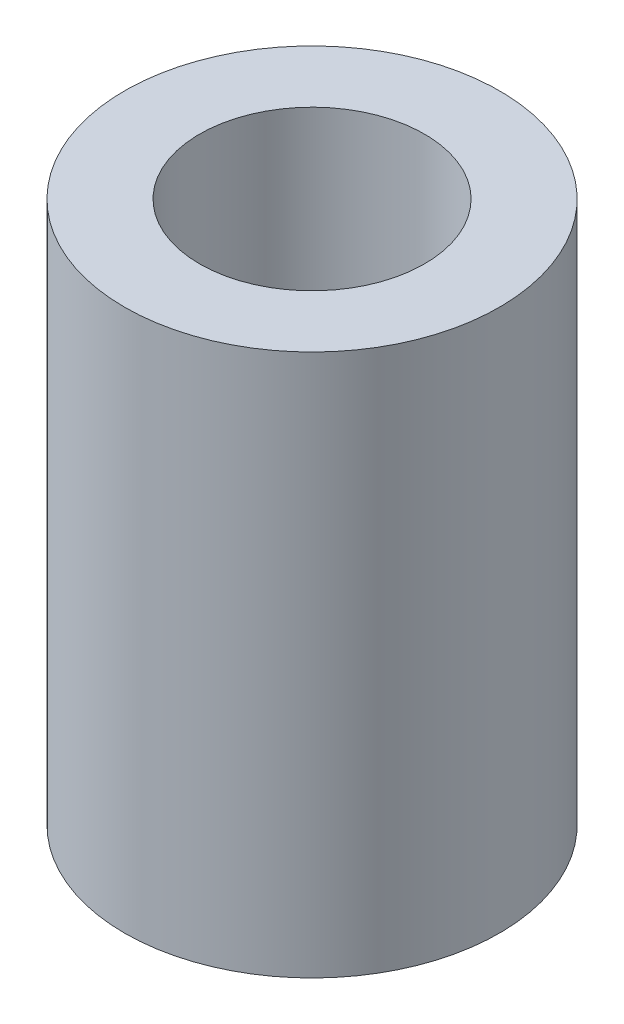
ISO-10303-21;
HEADER;
FILE_DESCRIPTION(('STEP AP214'),'2;1');
FILE_NAME('part.step','',(''),(''),'','','');
FILE_SCHEMA(('AUTOMOTIVE_DESIGN { 1 0 10303 214 1 1 1 1 }'));
ENDSEC;
DATA;
#1=APPLICATION_CONTEXT('core data for automotive mechanical design processes');
#2=APPLICATION_PROTOCOL_DEFINITION('international standard','automotive_design',2000,#1);
#3=PRODUCT_CONTEXT('',#1,'mechanical');
#4=PRODUCT('Part','Part','',(#3));
#5=PRODUCT_RELATED_PRODUCT_CATEGORY('part','',(#4));
#6=PRODUCT_DEFINITION_FORMATION('','',#4);
#7=PRODUCT_DEFINITION_CONTEXT('part definition',#1,'design');
#8=PRODUCT_DEFINITION('design','',#6,#7);
#9=PRODUCT_DEFINITION_SHAPE('','',#8);
#10=(LENGTH_UNIT() NAMED_UNIT(*) SI_UNIT(.MILLI.,.METRE.));
#11=(NAMED_UNIT(*) PLANE_ANGLE_UNIT() SI_UNIT($,.RADIAN.));
#12=(NAMED_UNIT(*) SI_UNIT($,.STERADIAN.) SOLID_ANGLE_UNIT());
#13=UNCERTAINTY_MEASURE_WITH_UNIT(LENGTH_MEASURE(1.E-05),#10,'distance_accuracy_value','');
#14=(GEOMETRIC_REPRESENTATION_CONTEXT(3) GLOBAL_UNCERTAINTY_ASSIGNED_CONTEXT((#13)) GLOBAL_UNIT_ASSIGNED_CONTEXT((#10,
#11,#12)) REPRESENTATION_CONTEXT('',''));
#15=CARTESIAN_POINT('',(0.,0.,0.));
#16=DIRECTION('',(0.,0.,1.));
#17=DIRECTION('',(1.,0.,0.));
#18=AXIS2_PLACEMENT_3D('',#15,#16,#17);
#19=CARTESIAN_POINT('',(0.,7.23,0.));
#20=DIRECTION('',(0.,1.,0.));
#21=DIRECTION('',(0.,0.,1.));
#22=AXIS2_PLACEMENT_3D('',#19,#20,#21);
#23=PLANE('',#22);
#24=CARTESIAN_POINT('',(0.,7.23,0.));
#25=DIRECTION('',(0.,1.,0.));
#26=DIRECTION('',(0.,0.,1.));
#27=AXIS2_PLACEMENT_3D('',#24,#25,#26);
#28=CIRCLE('',#27,2.5);
#29=CARTESIAN_POINT('',(0.,7.23,2.5));
#30=VERTEX_POINT('',#29);
#31=EDGE_CURVE('E10',#30,#30,#28,.T.);
#32=ORIENTED_EDGE('',*,*,#31,.T.);
#33=EDGE_LOOP('',(#32));
#34=FACE_BOUND('',#33,.T.);
#35=CARTESIAN_POINT('',(0.,7.23,0.));
#36=DIRECTION('',(0.,1.,0.));
#37=DIRECTION('',(0.,0.,1.));
#38=AXIS2_PLACEMENT_3D('',#35,#36,#37);
#39=CIRCLE('',#38,1.5);
#40=CARTESIAN_POINT('',(0.,7.23,1.5));
#41=VERTEX_POINT('',#40);
#42=EDGE_CURVE('E50',#41,#41,#39,.T.);
#43=ORIENTED_EDGE('',*,*,#42,.F.);
#44=EDGE_LOOP('',(#43));
#45=FACE_BOUND('',#44,.T.);
#46=ADVANCED_FACE('F37',(#34,#45),#23,.T.);
#47=CARTESIAN_POINT('',(0.,0.,0.));
#48=DIRECTION('',(0.,1.,0.));
#49=DIRECTION('',(0.,0.,1.));
#50=AXIS2_PLACEMENT_3D('',#47,#48,#49);
#51=PLANE('',#50);
#52=CARTESIAN_POINT('',(0.,0.,0.));
#53=DIRECTION('',(0.,1.,0.));
#54=DIRECTION('',(0.,0.,1.));
#55=AXIS2_PLACEMENT_3D('',#52,#53,#54);
#56=CIRCLE('',#55,2.5);
#57=CARTESIAN_POINT('',(0.,0.,2.5));
#58=VERTEX_POINT('',#57);
#59=EDGE_CURVE('E41',#58,#58,#56,.T.);
#60=ORIENTED_EDGE('',*,*,#59,.F.);
#61=EDGE_LOOP('',(#60));
#62=FACE_BOUND('',#61,.T.);
#63=CARTESIAN_POINT('',(0.,0.,0.));
#64=DIRECTION('',(0.,1.,0.));
#65=DIRECTION('',(0.,0.,1.));
#66=AXIS2_PLACEMENT_3D('',#63,#64,#65);
#67=CIRCLE('',#66,1.5);
#68=CARTESIAN_POINT('',(0.,0.,1.5));
#69=VERTEX_POINT('',#68);
#70=EDGE_CURVE('E52',#69,#69,#67,.T.);
#71=ORIENTED_EDGE('',*,*,#70,.T.);
#72=EDGE_LOOP('',(#71));
#73=FACE_BOUND('',#72,.T.);
#74=ADVANCED_FACE('F64',(#62,#73),#51,.F.);
#75=CARTESIAN_POINT('',(0.,7.23,0.));
#76=DIRECTION('',(0.,-1.,0.));
#77=DIRECTION('',(0.,0.,-1.));
#78=AXIS2_PLACEMENT_3D('',#75,#76,#77);
#79=CYLINDRICAL_SURFACE('',#78,2.5);
#80=ORIENTED_EDGE('',*,*,#31,.F.);
#81=EDGE_LOOP('',(#80));
#82=FACE_BOUND('',#81,.T.);
#83=ORIENTED_EDGE('',*,*,#59,.T.);
#84=EDGE_LOOP('',(#83));
#85=FACE_BOUND('',#84,.T.);
#86=ADVANCED_FACE('F39',(#82,#85),#79,.T.);
#87=CARTESIAN_POINT('',(0.,7.23,0.));
#88=DIRECTION('',(0.,-1.,0.));
#89=DIRECTION('',(0.,0.,-1.));
#90=AXIS2_PLACEMENT_3D('',#87,#88,#89);
#91=CYLINDRICAL_SURFACE('',#90,1.5);
#92=ORIENTED_EDGE('',*,*,#42,.T.);
#93=EDGE_LOOP('',(#92));
#94=FACE_BOUND('',#93,.T.);
#95=ORIENTED_EDGE('',*,*,#70,.F.);
#96=EDGE_LOOP('',(#95));
#97=FACE_BOUND('',#96,.T.);
#98=ADVANCED_FACE('F60',(#94,#97),#91,.F.);
#99=CLOSED_SHELL('',(#46,#74,#86,#98));
#100=MANIFOLD_SOLID_BREP('B2',#99);
#101=ADVANCED_BREP_SHAPE_REPRESENTATION('',(#18,#100),#14);
#102=SHAPE_DEFINITION_REPRESENTATION(#9,#101);
ENDSEC;
END-ISO-10303-21;
